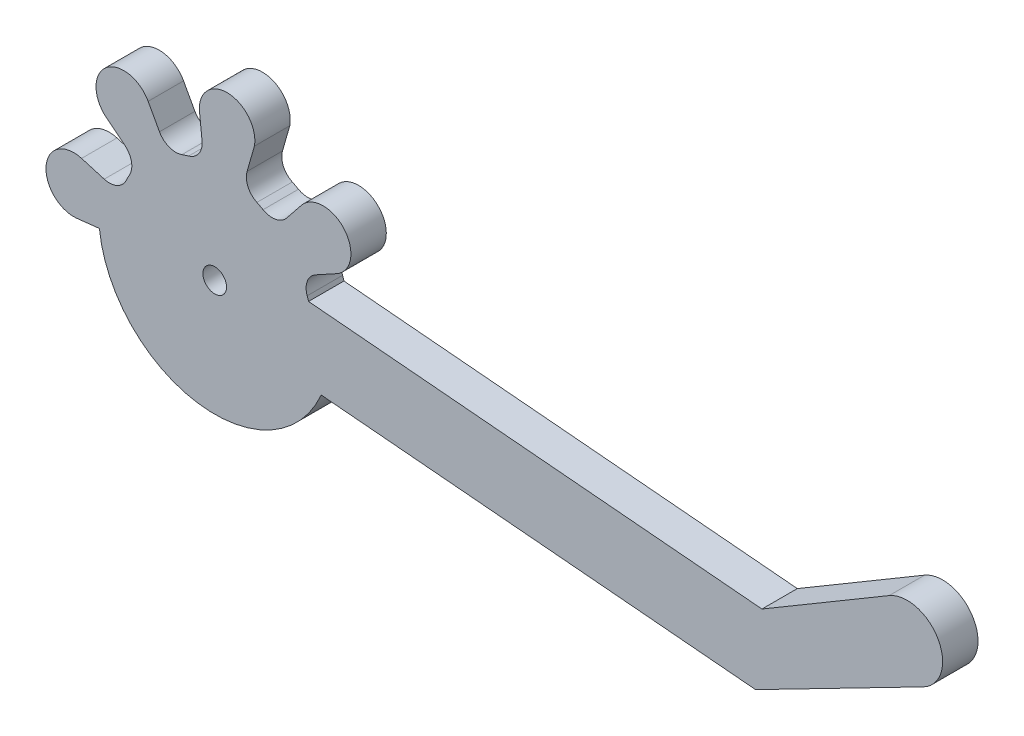
ISO-10303-21;
HEADER;
FILE_DESCRIPTION(('STEP AP214'),'2;1');
FILE_NAME('part.step','',(''),(''),'','','');
FILE_SCHEMA(('AUTOMOTIVE_DESIGN { 1 0 10303 214 1 1 1 1 }'));
ENDSEC;
DATA;
#1=APPLICATION_CONTEXT('core data for automotive mechanical design processes');
#2=APPLICATION_PROTOCOL_DEFINITION('international standard','automotive_design',2000,#1);
#3=PRODUCT_CONTEXT('',#1,'mechanical');
#4=PRODUCT('Part','Part','',(#3));
#5=PRODUCT_RELATED_PRODUCT_CATEGORY('part','',(#4));
#6=PRODUCT_DEFINITION_FORMATION('','',#4);
#7=PRODUCT_DEFINITION_CONTEXT('part definition',#1,'design');
#8=PRODUCT_DEFINITION('design','',#6,#7);
#9=PRODUCT_DEFINITION_SHAPE('','',#8);
#10=(LENGTH_UNIT() NAMED_UNIT(*) SI_UNIT(.MILLI.,.METRE.));
#11=(NAMED_UNIT(*) PLANE_ANGLE_UNIT() SI_UNIT($,.RADIAN.));
#12=(NAMED_UNIT(*) SI_UNIT($,.STERADIAN.) SOLID_ANGLE_UNIT());
#13=UNCERTAINTY_MEASURE_WITH_UNIT(LENGTH_MEASURE(1.E-05),#10,'distance_accuracy_value','');
#14=(GEOMETRIC_REPRESENTATION_CONTEXT(3) GLOBAL_UNCERTAINTY_ASSIGNED_CONTEXT((#13)) GLOBAL_UNIT_ASSIGNED_CONTEXT((#10,
#11,#12)) REPRESENTATION_CONTEXT('',''));
#15=CARTESIAN_POINT('',(0.,0.,0.));
#16=DIRECTION('',(0.,0.,1.));
#17=DIRECTION('',(1.,0.,0.));
#18=AXIS2_PLACEMENT_3D('',#15,#16,#17);
#19=CARTESIAN_POINT('',(2.20552189568856,24.9695299031335,3.));
#20=DIRECTION('',(0.,0.,1.));
#21=DIRECTION('',(1.,0.,0.));
#22=AXIS2_PLACEMENT_3D('',#19,#20,#21);
#23=PLANE('',#22);
#24=CARTESIAN_POINT('',(2.20552189568856,24.9695299031335,3.));
#25=DIRECTION('',(0.,0.,1.));
#26=DIRECTION('',(1.,0.,0.));
#27=AXIS2_PLACEMENT_3D('',#24,#25,#26);
#28=CIRCLE('',#27,2.35395199285645);
#29=CARTESIAN_POINT('',(4.27074653256969,26.0991037979682,3.));
#30=VERTEX_POINT('',#29);
#31=CARTESIAN_POINT('',(0.734486271788519,23.1318291173999,3.));
#32=VERTEX_POINT('',#31);
#33=EDGE_CURVE('E155',#30,#32,#28,.T.);
#34=ORIENTED_EDGE('',*,*,#33,.T.);
#35=DIRECTION('',(0.780687452995079,-0.624921675681086,0.));
#36=VECTOR('',#35,1.);
#37=CARTESIAN_POINT('',(2.2964918745804,21.881480908299,3.));
#38=LINE('',#37,#36);
#39=CARTESIAN_POINT('',(2.2964918745804,21.881480908299,3.));
#40=VERTEX_POINT('',#39);
#41=EDGE_CURVE('E468',#32,#40,#38,.T.);
#42=ORIENTED_EDGE('',*,*,#41,.T.);
#43=CARTESIAN_POINT('',(1.31580145927092,20.6563470519233,3.));
#44=DIRECTION('',(0.,0.,-1.));
#45=DIRECTION('',(1.,0.,0.));
#46=AXIS2_PLACEMENT_3D('',#43,#44,#45);
#47=CIRCLE('',#46,1.56930132757158);
#48=CARTESIAN_POINT('',(2.68115330109699,19.8827056575066,3.));
#49=VERTEX_POINT('',#48);
#50=EDGE_CURVE('E393',#40,#49,#47,.T.);
#51=ORIENTED_EDGE('',*,*,#50,.T.);
#52=CARTESIAN_POINT('',(9.91163847667758,15.7857377794938,3.));
#53=DIRECTION('',(0.,0.,1.));
#54=DIRECTION('',(1.,0.,0.));
#55=AXIS2_PLACEMENT_3D('',#52,#53,#54);
#56=CIRCLE('',#55,8.31053919236048);
#57=CARTESIAN_POINT('',(2.40836294622478,19.3586802600103,3.));
#58=VERTEX_POINT('',#57);
#59=EDGE_CURVE('E412',#49,#58,#56,.T.);
#60=ORIENTED_EDGE('',*,*,#59,.T.);
#61=CARTESIAN_POINT('',(0.991499373512298,20.0333685378642,3.));
#62=DIRECTION('',(0.,0.,-1.));
#63=DIRECTION('',(1.,0.,0.));
#64=AXIS2_PLACEMENT_3D('',#61,#62,#63);
#65=CIRCLE('',#64,1.56930132732789);
#66=CARTESIAN_POINT('',(0.550429384278587,18.5273260681608,3.));
#67=VERTEX_POINT('',#66);
#68=EDGE_CURVE('E409',#58,#67,#65,.T.);
#69=ORIENTED_EDGE('',*,*,#68,.T.);
#70=DIRECTION('',(-0.959689795584554,0.281061374526768,0.));
#71=VECTOR('',#70,1.);
#72=CARTESIAN_POINT('',(-1.36972551868818,19.0896758803763,3.));
#73=LINE('',#72,#71);
#74=CARTESIAN_POINT('',(-1.36972551868818,19.0896758803763,3.));
#75=VERTEX_POINT('',#74);
#76=EDGE_CURVE('E411',#67,#75,#73,.T.);
#77=ORIENTED_EDGE('',*,*,#76,.T.);
#78=CARTESIAN_POINT('',(-2.03133050323162,16.8306121740802,3.));
#79=DIRECTION('',(0.,0.,1.));
#80=DIRECTION('',(1.,0.,0.));
#81=AXIS2_PLACEMENT_3D('',#78,#79,#80);
#82=CIRCLE('',#81,2.35395199285732);
#83=CARTESIAN_POINT('',(-1.77205908085418,14.490982221664,3.));
#84=VERTEX_POINT('',#83);
#85=EDGE_CURVE('E414',#75,#84,#82,.T.);
#86=ORIENTED_EDGE('',*,*,#85,.T.);
#87=DIRECTION('',(0.993915746537626,0.110143037839678,0.));
#88=VECTOR('',#87,1.);
#89=CARTESIAN_POINT('',(0.138961898257982,14.7027563652451,3.));
#90=LINE('',#89,#88);
#91=CARTESIAN_POINT('',(0.138961898257964,14.7027563652451,3.));
#92=VERTEX_POINT('',#91);
#93=EDGE_CURVE('E420',#84,#92,#90,.T.);
#94=ORIENTED_EDGE('',*,*,#93,.T.);
#95=CARTESIAN_POINT('',(9.91163847667758,15.7857377794938,3.));
#96=DIRECTION('',(0.,0.,1.));
#97=DIRECTION('',(1.,0.,0.));
#98=AXIS2_PLACEMENT_3D('',#95,#96,#97);
#99=CIRCLE('',#98,9.83249999999997);
#100=CARTESIAN_POINT('',(18.9348827743616,11.8794455996494,3.));
#101=VERTEX_POINT('',#100);
#102=EDGE_CURVE('E422',#92,#101,#99,.T.);
#103=ORIENTED_EDGE('',*,*,#102,.T.);
#104=DIRECTION('',(0.996194698091745,-0.0871557427476604,0.));
#105=VECTOR('',#104,1.);
#106=CARTESIAN_POINT('',(55.7361887621411,8.65974852276994,3.));
#107=LINE('',#106,#105);
#108=CARTESIAN_POINT('',(55.7361887621411,8.65974852276994,3.));
#109=VERTEX_POINT('',#108);
#110=EDGE_CURVE('E424',#101,#109,#107,.T.);
#111=ORIENTED_EDGE('',*,*,#110,.T.);
#112=DIRECTION('',(0.889291076636205,0.457341645835167,0.));
#113=VECTOR('',#112,1.);
#114=CARTESIAN_POINT('',(55.7361887621411,8.65974852276994,3.));
#115=LINE('',#114,#113);
#116=CARTESIAN_POINT('',(69.9643683761599,15.9769692313453,3.));
#117=VERTEX_POINT('',#116);
#118=EDGE_CURVE('E426',#109,#117,#115,.T.);
#119=ORIENTED_EDGE('',*,*,#118,.T.);
#120=CARTESIAN_POINT('',(68.5852824960658,18.6411993519102,3.));
#121=DIRECTION('',(0.,0.,1.));
#122=DIRECTION('',(1.,0.,0.));
#123=AXIS2_PLACEMENT_3D('',#120,#121,#122);
#124=CIRCLE('',#123,3.00000000000001);
#125=CARTESIAN_POINT('',(67.0578742515332,21.2232574563172,3.));
#126=VERTEX_POINT('',#125);
#127=EDGE_CURVE('E428',#117,#126,#124,.T.);
#128=ORIENTED_EDGE('',*,*,#127,.T.);
#129=DIRECTION('',(-0.860686034802284,-0.509136081510947,0.));
#130=VECTOR('',#129,1.);
#131=CARTESIAN_POINT('',(56.2774259246038,14.8461175979193,3.));
#132=LINE('',#131,#130);
#133=CARTESIAN_POINT('',(56.2774259246038,14.8461175979193,3.));
#134=VERTEX_POINT('',#133);
#135=EDGE_CURVE('E430',#126,#134,#132,.T.);
#136=ORIENTED_EDGE('',*,*,#135,.T.);
#137=DIRECTION('',(-0.996194698218179,0.0871557413025172,0.));
#138=VECTOR('',#137,1.);
#139=CARTESIAN_POINT('',(17.861622062935,18.2070648798958,3.));
#140=LINE('',#139,#138);
#141=CARTESIAN_POINT('',(17.8616219989625,18.2070648604117,3.));
#142=VERTEX_POINT('',#141);
#143=EDGE_CURVE('E432',#134,#142,#140,.T.);
#144=ORIENTED_EDGE('',*,*,#143,.T.);
#145=CARTESIAN_POINT('',(9.91163847667758,15.7857377794938,3.));
#146=DIRECTION('',(0.,0.,1.));
#147=DIRECTION('',(1.,0.,0.));
#148=AXIS2_PLACEMENT_3D('',#145,#146,#147);
#149=CIRCLE('',#148,8.31053926273072);
#150=CARTESIAN_POINT('',(17.7437073453175,18.5649029352116,3.));
#151=VERTEX_POINT('',#150);
#152=EDGE_CURVE('E434',#142,#151,#149,.T.);
#153=ORIENTED_EDGE('',*,*,#152,.T.);
#154=CARTESIAN_POINT('',(19.2226578423204,19.0897001190196,3.));
#155=DIRECTION('',(0.,0.,-1.));
#156=DIRECTION('',(1.,0.,0.));
#157=AXIS2_PLACEMENT_3D('',#154,#155,#156);
#158=CIRCLE('',#157,1.56930132757161);
#159=CARTESIAN_POINT('',(18.4696085795766,20.4665165427301,3.));
#160=VERTEX_POINT('',#159);
#161=EDGE_CURVE('E436',#151,#160,#158,.T.);
#162=ORIENTED_EDGE('',*,*,#161,.T.);
#163=DIRECTION('',(0.877343566555494,0.479862757696079,0.));
#164=VECTOR('',#163,1.);
#165=CARTESIAN_POINT('',(20.225004495414,21.4266297265872,3.));
#166=LINE('',#165,#164);
#167=CARTESIAN_POINT('',(20.225004495414,21.4266297265872,3.));
#168=VERTEX_POINT('',#167);
#169=EDGE_CURVE('E438',#160,#168,#166,.T.);
#170=ORIENTED_EDGE('',*,*,#169,.T.);
#171=CARTESIAN_POINT('',(19.0954306005801,23.4918543634683,3.));
#172=DIRECTION('',(0.,0.,1.));
#173=DIRECTION('',(1.,0.,0.));
#174=AXIS2_PLACEMENT_3D('',#171,#172,#173);
#175=CIRCLE('',#174,2.35395199285601);
#176=CARTESIAN_POINT('',(17.2577298148456,24.9628899873683,3.));
#177=VERTEX_POINT('',#176);
#178=EDGE_CURVE('E440',#168,#177,#175,.T.);
#179=ORIENTED_EDGE('',*,*,#178,.T.);
#180=DIRECTION('',(-0.624921675680768,-0.780687452995333,0.));
#181=VECTOR('',#180,1.);
#182=CARTESIAN_POINT('',(16.0073816057455,23.400884384576,3.));
#183=LINE('',#182,#181);
#184=CARTESIAN_POINT('',(16.0073816057455,23.400884384576,3.));
#185=VERTEX_POINT('',#184);
#186=EDGE_CURVE('E442',#177,#185,#183,.T.);
#187=ORIENTED_EDGE('',*,*,#186,.T.);
#188=CARTESIAN_POINT('',(14.7822477493697,24.3815747998855,3.));
#189=DIRECTION('',(0.,0.,-1.));
#190=DIRECTION('',(1.,0.,0.));
#191=AXIS2_PLACEMENT_3D('',#188,#189,#190);
#192=CIRCLE('',#191,1.56930132757157);
#193=CARTESIAN_POINT('',(14.0086063553325,23.0162229587288,3.));
#194=VERTEX_POINT('',#193);
#195=EDGE_CURVE('E444',#185,#194,#192,.T.);
#196=ORIENTED_EDGE('',*,*,#195,.T.);
#197=DIRECTION('',(-0.887010834511609,0.46174861067362,0.));
#198=VECTOR('',#197,1.);
#199=CARTESIAN_POINT('',(13.4845809574635,23.2890133125883,3.));
#200=LINE('',#199,#198);
#201=CARTESIAN_POINT('',(13.4845809574635,23.2890133125883,3.));
#202=VERTEX_POINT('',#201);
#203=EDGE_CURVE('E446',#194,#202,#200,.T.);
#204=ORIENTED_EDGE('',*,*,#203,.T.);
#205=CARTESIAN_POINT('',(14.1592692355152,24.7058768854765,3.));
#206=DIRECTION('',(0.,0.,-1.));
#207=DIRECTION('',(1.,0.,0.));
#208=AXIS2_PLACEMENT_3D('',#205,#206,#207);
#209=CIRCLE('',#208,1.56930132757157);
#210=CARTESIAN_POINT('',(12.6532267656069,25.1469468748776,3.));
#211=VERTEX_POINT('',#210);
#212=EDGE_CURVE('E448',#202,#211,#209,.T.);
#213=ORIENTED_EDGE('',*,*,#212,.T.);
#214=DIRECTION('',(0.275451101956375,0.961315083846612,0.));
#215=VECTOR('',#214,1.);
#216=CARTESIAN_POINT('',(13.2727699187403,27.3091316473145,3.));
#217=LINE('',#216,#215);
#218=CARTESIAN_POINT('',(13.2727699187403,27.3091316473145,3.));
#219=VERTEX_POINT('',#218);
#220=EDGE_CURVE('E450',#211,#219,#217,.T.);
#221=ORIENTED_EDGE('',*,*,#220,.T.);
#222=CARTESIAN_POINT('',(10.9565128712596,27.7287067593819,3.));
#223=DIRECTION('',(0.,0.,1.));
#224=DIRECTION('',(1.,0.,0.));
#225=AXIS2_PLACEMENT_3D('',#222,#223,#224);
#226=CIRCLE('',#225,2.35395199285593);
#227=CARTESIAN_POINT('',(8.60258651932652,27.7177197513502,3.));
#228=VERTEX_POINT('',#227);
#229=EDGE_CURVE('E452',#219,#228,#226,.T.);
#230=ORIENTED_EDGE('',*,*,#229,.T.);
#231=DIRECTION('',(0.104335769573791,-0.994542129418078,0.));
#232=VECTOR('',#231,1.);
#233=CARTESIAN_POINT('',(8.83725797740522,25.4808008827337,3.));
#234=LINE('',#233,#232);
#235=CARTESIAN_POINT('',(8.83725797740522,25.4808008827337,3.));
#236=VERTEX_POINT('',#235);
#237=EDGE_CURVE('E454',#228,#236,#234,.T.);
#238=ORIENTED_EDGE('',*,*,#237,.T.);
#239=CARTESIAN_POINT('',(7.27750467678122,25.3079532679456,3.));
#240=DIRECTION('',(0.,0.,-1.));
#241=DIRECTION('',(1.,0.,0.));
#242=AXIS2_PLACEMENT_3D('',#239,#240,#241);
#243=CIRCLE('',#242,1.56930132758033);
#244=CARTESIAN_POINT('',(7.69590714643339,23.7954566464173,3.));
#245=VERTEX_POINT('',#244);
#246=EDGE_CURVE('E238',#236,#245,#243,.T.);
#247=ORIENTED_EDGE('',*,*,#246,.T.);
#248=CARTESIAN_POINT('',(9.91163847667758,15.7857377794938,3.));
#249=DIRECTION('',(0.,0.,1.));
#250=DIRECTION('',(1.,0.,0.));
#251=AXIS2_PLACEMENT_3D('',#248,#249,#250);
#252=CIRCLE('',#251,8.31053919159139);
#253=CARTESIAN_POINT('',(7.13247332479957,23.6178066449701,3.));
#254=VERTEX_POINT('',#253);
#255=EDGE_CURVE('E232',#245,#254,#252,.T.);
#256=ORIENTED_EDGE('',*,*,#255,.T.);
#257=CARTESIAN_POINT('',(6.60767614226689,25.0967571439252,3.));
#258=DIRECTION('',(0.,0.,-1.));
#259=DIRECTION('',(1.,0.,0.));
#260=AXIS2_PLACEMENT_3D('',#257,#258,#259);
#261=CIRCLE('',#260,1.56930132898491);
#262=CARTESIAN_POINT('',(5.23085971642636,24.3437078821305,3.));
#263=VERTEX_POINT('',#262);
#264=EDGE_CURVE('E236',#254,#263,#261,.T.);
#265=ORIENTED_EDGE('',*,*,#264,.T.);
#266=DIRECTION('',(-0.479862757695843,0.877343566555623,0.));
#267=VECTOR('',#266,1.);
#268=CARTESIAN_POINT('',(4.27074653256969,26.0991037979682,3.));
#269=LINE('',#268,#267);
#270=EDGE_CURVE('E50',#263,#30,#269,.T.);
#271=ORIENTED_EDGE('',*,*,#270,.T.);
#272=EDGE_LOOP('',(#34,#42,#51,#60,#69,#77,#86,#94,#103,#111,#119,#128,#136,#144,#153,#162,#170,
#179,#187,#196,#204,#213,#221,#230,#238,#247,#256,#265,#271));
#273=FACE_BOUND('',#272,.T.);
#274=CARTESIAN_POINT('',(9.91163847667758,15.7857377794938,3.));
#275=DIRECTION('',(0.,0.,1.));
#276=DIRECTION('',(1.,0.,0.));
#277=AXIS2_PLACEMENT_3D('',#274,#275,#276);
#278=CIRCLE('',#277,0.999999999999999);
#279=CARTESIAN_POINT('',(10.9116384766776,15.7857377794938,3.));
#280=VERTEX_POINT('',#279);
#281=EDGE_CURVE('E258',#280,#280,#278,.T.);
#282=ORIENTED_EDGE('',*,*,#281,.F.);
#283=EDGE_LOOP('',(#282));
#284=FACE_BOUND('',#283,.T.);
#285=ADVANCED_FACE('F33',(#273,#284),#23,.T.);
#286=CARTESIAN_POINT('',(2.20552189568856,24.9695299031335,0.));
#287=DIRECTION('',(0.,0.,1.));
#288=DIRECTION('',(1.,0.,0.));
#289=AXIS2_PLACEMENT_3D('',#286,#287,#288);
#290=PLANE('',#289);
#291=CARTESIAN_POINT('',(2.20552189568856,24.9695299031335,0.));
#292=DIRECTION('',(0.,0.,1.));
#293=DIRECTION('',(1.,0.,0.));
#294=AXIS2_PLACEMENT_3D('',#291,#292,#293);
#295=CIRCLE('',#294,2.35395199285548);
#296=CARTESIAN_POINT('',(4.27074653256969,26.0991037979682,0.));
#297=VERTEX_POINT('',#296);
#298=CARTESIAN_POINT('',(0.734486271788519,23.1318291173999,0.));
#299=VERTEX_POINT('',#298);
#300=EDGE_CURVE('E149',#297,#299,#295,.T.);
#301=ORIENTED_EDGE('',*,*,#300,.F.);
#302=DIRECTION('',(-0.479862757695843,0.877343566555623,0.));
#303=VECTOR('',#302,1.);
#304=CARTESIAN_POINT('',(4.27074653256969,26.0991037979682,0.));
#305=LINE('',#304,#303);
#306=CARTESIAN_POINT('',(5.23085971642636,24.3437078821305,0.));
#307=VERTEX_POINT('',#306);
#308=EDGE_CURVE('E312',#307,#297,#305,.T.);
#309=ORIENTED_EDGE('',*,*,#308,.F.);
#310=CARTESIAN_POINT('',(6.60767614226689,25.0967571439252,0.));
#311=DIRECTION('',(0.,0.,-1.));
#312=DIRECTION('',(1.,0.,0.));
#313=AXIS2_PLACEMENT_3D('',#310,#311,#312);
#314=CIRCLE('',#313,1.56930132898491);
#315=CARTESIAN_POINT('',(7.13247332479957,23.6178066449701,0.));
#316=VERTEX_POINT('',#315);
#317=EDGE_CURVE('E142',#316,#307,#314,.T.);
#318=ORIENTED_EDGE('',*,*,#317,.F.);
#319=CARTESIAN_POINT('',(9.91163847667758,15.7857377794938,0.));
#320=DIRECTION('',(0.,0.,1.));
#321=DIRECTION('',(1.,0.,0.));
#322=AXIS2_PLACEMENT_3D('',#319,#320,#321);
#323=CIRCLE('',#322,8.31053919159139);
#324=CARTESIAN_POINT('',(7.69590714643339,23.7954566464173,0.));
#325=VERTEX_POINT('',#324);
#326=EDGE_CURVE('E246',#325,#316,#323,.T.);
#327=ORIENTED_EDGE('',*,*,#326,.F.);
#328=CARTESIAN_POINT('',(7.27750467678122,25.3079532679456,0.));
#329=DIRECTION('',(0.,0.,-1.));
#330=DIRECTION('',(1.,0.,0.));
#331=AXIS2_PLACEMENT_3D('',#328,#329,#330);
#332=CIRCLE('',#331,1.56930132758033);
#333=CARTESIAN_POINT('',(8.83725797740522,25.4808008827337,0.));
#334=VERTEX_POINT('',#333);
#335=EDGE_CURVE('E308',#334,#325,#332,.T.);
#336=ORIENTED_EDGE('',*,*,#335,.F.);
#337=DIRECTION('',(0.104335769573791,-0.994542129418078,0.));
#338=VECTOR('',#337,1.);
#339=CARTESIAN_POINT('',(8.83725797740522,25.4808008827337,0.));
#340=LINE('',#339,#338);
#341=CARTESIAN_POINT('',(8.60258651932652,27.7177197513502,0.));
#342=VERTEX_POINT('',#341);
#343=EDGE_CURVE('E306',#342,#334,#340,.T.);
#344=ORIENTED_EDGE('',*,*,#343,.F.);
#345=CARTESIAN_POINT('',(10.9565128712596,27.7287067593819,0.));
#346=DIRECTION('',(0.,0.,1.));
#347=DIRECTION('',(1.,0.,0.));
#348=AXIS2_PLACEMENT_3D('',#345,#346,#347);
#349=CIRCLE('',#348,2.35395199285593);
#350=CARTESIAN_POINT('',(13.2727699187403,27.3091316473145,0.));
#351=VERTEX_POINT('',#350);
#352=EDGE_CURVE('E304',#351,#342,#349,.T.);
#353=ORIENTED_EDGE('',*,*,#352,.F.);
#354=DIRECTION('',(0.275451101956375,0.961315083846612,0.));
#355=VECTOR('',#354,1.);
#356=CARTESIAN_POINT('',(13.2727699187403,27.3091316473145,0.));
#357=LINE('',#356,#355);
#358=CARTESIAN_POINT('',(12.6532267656069,25.1469468748776,0.));
#359=VERTEX_POINT('',#358);
#360=EDGE_CURVE('E302',#359,#351,#357,.T.);
#361=ORIENTED_EDGE('',*,*,#360,.F.);
#362=CARTESIAN_POINT('',(14.1592692355152,24.7058768854765,0.));
#363=DIRECTION('',(0.,0.,-1.));
#364=DIRECTION('',(1.,0.,0.));
#365=AXIS2_PLACEMENT_3D('',#362,#363,#364);
#366=CIRCLE('',#365,1.56930132757157);
#367=CARTESIAN_POINT('',(13.4845809574635,23.2890133125883,0.));
#368=VERTEX_POINT('',#367);
#369=EDGE_CURVE('E300',#368,#359,#366,.T.);
#370=ORIENTED_EDGE('',*,*,#369,.F.);
#371=DIRECTION('',(-0.887010834511609,0.46174861067362,0.));
#372=VECTOR('',#371,1.);
#373=CARTESIAN_POINT('',(13.4845809574635,23.2890133125883,0.));
#374=LINE('',#373,#372);
#375=CARTESIAN_POINT('',(14.0086063553325,23.0162229587288,0.));
#376=VERTEX_POINT('',#375);
#377=EDGE_CURVE('E298',#376,#368,#374,.T.);
#378=ORIENTED_EDGE('',*,*,#377,.F.);
#379=CARTESIAN_POINT('',(14.7822477493697,24.3815747998855,0.));
#380=DIRECTION('',(0.,0.,-1.));
#381=DIRECTION('',(1.,0.,0.));
#382=AXIS2_PLACEMENT_3D('',#379,#380,#381);
#383=CIRCLE('',#382,1.56930132757157);
#384=CARTESIAN_POINT('',(16.0073816057455,23.400884384576,0.));
#385=VERTEX_POINT('',#384);
#386=EDGE_CURVE('E296',#385,#376,#383,.T.);
#387=ORIENTED_EDGE('',*,*,#386,.F.);
#388=DIRECTION('',(-0.624921675680768,-0.780687452995333,0.));
#389=VECTOR('',#388,1.);
#390=CARTESIAN_POINT('',(16.0073816057455,23.400884384576,0.));
#391=LINE('',#390,#389);
#392=CARTESIAN_POINT('',(17.2577298148456,24.9628899873683,0.));
#393=VERTEX_POINT('',#392);
#394=EDGE_CURVE('E294',#393,#385,#391,.T.);
#395=ORIENTED_EDGE('',*,*,#394,.F.);
#396=CARTESIAN_POINT('',(19.0954306005801,23.4918543634683,0.));
#397=DIRECTION('',(0.,0.,1.));
#398=DIRECTION('',(1.,0.,0.));
#399=AXIS2_PLACEMENT_3D('',#396,#397,#398);
#400=CIRCLE('',#399,2.35395199285622);
#401=CARTESIAN_POINT('',(20.225004495414,21.4266297265872,0.));
#402=VERTEX_POINT('',#401);
#403=EDGE_CURVE('E292',#402,#393,#400,.T.);
#404=ORIENTED_EDGE('',*,*,#403,.F.);
#405=DIRECTION('',(0.877343566555494,0.479862757696079,0.));
#406=VECTOR('',#405,1.);
#407=CARTESIAN_POINT('',(20.225004495414,21.4266297265872,0.));
#408=LINE('',#407,#406);
#409=CARTESIAN_POINT('',(18.4696085795766,20.4665165427301,0.));
#410=VERTEX_POINT('',#409);
#411=EDGE_CURVE('E289',#410,#402,#408,.T.);
#412=ORIENTED_EDGE('',*,*,#411,.F.);
#413=CARTESIAN_POINT('',(19.2226578423204,19.0897001190196,0.));
#414=DIRECTION('',(0.,0.,-1.));
#415=DIRECTION('',(1.,0.,0.));
#416=AXIS2_PLACEMENT_3D('',#413,#414,#415);
#417=CIRCLE('',#416,1.56930132757161);
#418=CARTESIAN_POINT('',(17.7437073453175,18.5649029352116,0.));
#419=VERTEX_POINT('',#418);
#420=EDGE_CURVE('E287',#419,#410,#417,.T.);
#421=ORIENTED_EDGE('',*,*,#420,.F.);
#422=CARTESIAN_POINT('',(9.91163847667758,15.7857377794938,0.));
#423=DIRECTION('',(0.,0.,1.));
#424=DIRECTION('',(1.,0.,0.));
#425=AXIS2_PLACEMENT_3D('',#422,#423,#424);
#426=CIRCLE('',#425,8.31053926273072);
#427=CARTESIAN_POINT('',(17.8616219989625,18.2070648604117,0.));
#428=VERTEX_POINT('',#427);
#429=EDGE_CURVE('E285',#428,#419,#426,.T.);
#430=ORIENTED_EDGE('',*,*,#429,.F.);
#431=DIRECTION('',(-0.996194698218179,0.0871557413025172,0.));
#432=VECTOR('',#431,1.);
#433=CARTESIAN_POINT('',(17.861622062935,18.2070648798958,0.));
#434=LINE('',#433,#432);
#435=CARTESIAN_POINT('',(56.2774259246038,14.8461175979193,0.));
#436=VERTEX_POINT('',#435);
#437=EDGE_CURVE('E283',#436,#428,#434,.T.);
#438=ORIENTED_EDGE('',*,*,#437,.F.);
#439=DIRECTION('',(-0.860686034802284,-0.509136081510947,0.));
#440=VECTOR('',#439,1.);
#441=CARTESIAN_POINT('',(56.2774259246038,14.8461175979193,0.));
#442=LINE('',#441,#440);
#443=CARTESIAN_POINT('',(67.0578742515332,21.2232574563172,0.));
#444=VERTEX_POINT('',#443);
#445=EDGE_CURVE('E281',#444,#436,#442,.T.);
#446=ORIENTED_EDGE('',*,*,#445,.F.);
#447=CARTESIAN_POINT('',(68.5852824960658,18.6411993519102,0.));
#448=DIRECTION('',(0.,0.,1.));
#449=DIRECTION('',(1.,0.,0.));
#450=AXIS2_PLACEMENT_3D('',#447,#448,#449);
#451=CIRCLE('',#450,3.00000000000001);
#452=CARTESIAN_POINT('',(69.9643683761599,15.9769692313453,0.));
#453=VERTEX_POINT('',#452);
#454=EDGE_CURVE('E279',#453,#444,#451,.T.);
#455=ORIENTED_EDGE('',*,*,#454,.F.);
#456=DIRECTION('',(0.889291076636205,0.457341645835167,0.));
#457=VECTOR('',#456,1.);
#458=CARTESIAN_POINT('',(55.7361887621411,8.65974852276994,0.));
#459=LINE('',#458,#457);
#460=CARTESIAN_POINT('',(55.7361887621411,8.65974852276994,0.));
#461=VERTEX_POINT('',#460);
#462=EDGE_CURVE('E277',#461,#453,#459,.T.);
#463=ORIENTED_EDGE('',*,*,#462,.F.);
#464=DIRECTION('',(0.996194698091745,-0.0871557427476604,0.));
#465=VECTOR('',#464,1.);
#466=CARTESIAN_POINT('',(55.7361887621411,8.65974852276994,0.));
#467=LINE('',#466,#465);
#468=CARTESIAN_POINT('',(18.9348827743616,11.8794455996494,0.));
#469=VERTEX_POINT('',#468);
#470=EDGE_CURVE('E275',#469,#461,#467,.T.);
#471=ORIENTED_EDGE('',*,*,#470,.F.);
#472=CARTESIAN_POINT('',(9.91163847667758,15.7857377794938,0.));
#473=DIRECTION('',(0.,0.,1.));
#474=DIRECTION('',(1.,0.,0.));
#475=AXIS2_PLACEMENT_3D('',#472,#473,#474);
#476=CIRCLE('',#475,9.83249999999997);
#477=CARTESIAN_POINT('',(0.138961898257964,14.7027563652451,0.));
#478=VERTEX_POINT('',#477);
#479=EDGE_CURVE('E273',#478,#469,#476,.T.);
#480=ORIENTED_EDGE('',*,*,#479,.F.);
#481=DIRECTION('',(0.993915746537626,0.110143037839678,0.));
#482=VECTOR('',#481,1.);
#483=CARTESIAN_POINT('',(0.138961898257982,14.7027563652451,0.));
#484=LINE('',#483,#482);
#485=CARTESIAN_POINT('',(-1.77205908085418,14.490982221664,0.));
#486=VERTEX_POINT('',#485);
#487=EDGE_CURVE('E271',#486,#478,#484,.T.);
#488=ORIENTED_EDGE('',*,*,#487,.F.);
#489=CARTESIAN_POINT('',(-2.03133050323162,16.8306121740802,0.));
#490=DIRECTION('',(0.,0.,1.));
#491=DIRECTION('',(1.,0.,0.));
#492=AXIS2_PLACEMENT_3D('',#489,#490,#491);
#493=CIRCLE('',#492,2.35395199286196);
#494=CARTESIAN_POINT('',(-1.36972551868818,19.0896758803763,0.));
#495=VERTEX_POINT('',#494);
#496=EDGE_CURVE('E269',#495,#486,#493,.T.);
#497=ORIENTED_EDGE('',*,*,#496,.F.);
#498=DIRECTION('',(-0.959689795584554,0.281061374526768,0.));
#499=VECTOR('',#498,1.);
#500=CARTESIAN_POINT('',(-1.36972551868818,19.0896758803763,0.));
#501=LINE('',#500,#499);
#502=CARTESIAN_POINT('',(0.550429384278587,18.5273260681608,0.));
#503=VERTEX_POINT('',#502);
#504=EDGE_CURVE('E266',#503,#495,#501,.T.);
#505=ORIENTED_EDGE('',*,*,#504,.F.);
#506=CARTESIAN_POINT('',(0.991499373512298,20.0333685378642,0.));
#507=DIRECTION('',(0.,0.,-1.));
#508=DIRECTION('',(1.,0.,0.));
#509=AXIS2_PLACEMENT_3D('',#506,#507,#508);
#510=CIRCLE('',#509,1.56930132732789);
#511=CARTESIAN_POINT('',(2.40836294622478,19.3586802600103,0.));
#512=VERTEX_POINT('',#511);
#513=EDGE_CURVE('E264',#512,#503,#510,.T.);
#514=ORIENTED_EDGE('',*,*,#513,.F.);
#515=CARTESIAN_POINT('',(9.91163847667758,15.7857377794938,0.));
#516=DIRECTION('',(0.,0.,1.));
#517=DIRECTION('',(1.,0.,0.));
#518=AXIS2_PLACEMENT_3D('',#515,#516,#517);
#519=CIRCLE('',#518,8.31053919236048);
#520=CARTESIAN_POINT('',(2.68115330109699,19.8827056575066,0.));
#521=VERTEX_POINT('',#520);
#522=EDGE_CURVE('E262',#521,#512,#519,.T.);
#523=ORIENTED_EDGE('',*,*,#522,.F.);
#524=CARTESIAN_POINT('',(1.31580145927092,20.6563470519233,0.));
#525=DIRECTION('',(0.,0.,-1.));
#526=DIRECTION('',(1.,0.,0.));
#527=AXIS2_PLACEMENT_3D('',#524,#525,#526);
#528=CIRCLE('',#527,1.56930132757158);
#529=CARTESIAN_POINT('',(2.2964918745804,21.881480908299,0.));
#530=VERTEX_POINT('',#529);
#531=EDGE_CURVE('E260',#530,#521,#528,.T.);
#532=ORIENTED_EDGE('',*,*,#531,.F.);
#533=DIRECTION('',(0.780687452995079,-0.624921675681086,0.));
#534=VECTOR('',#533,1.);
#535=CARTESIAN_POINT('',(2.2964918745804,21.881480908299,0.));
#536=LINE('',#535,#534);
#537=EDGE_CURVE('E257',#299,#530,#536,.T.);
#538=ORIENTED_EDGE('',*,*,#537,.F.);
#539=EDGE_LOOP('',(#301,#309,#318,#327,#336,#344,#353,#361,#370,#378,#387,#395,#404,#412,#421,
#430,#438,#446,#455,#463,#471,#480,#488,#497,#505,#514,#523,#532,#538));
#540=FACE_BOUND('',#539,.T.);
#541=CARTESIAN_POINT('',(9.91163847667758,15.7857377794938,0.));
#542=DIRECTION('',(0.,0.,1.));
#543=DIRECTION('',(1.,0.,0.));
#544=AXIS2_PLACEMENT_3D('',#541,#542,#543);
#545=CIRCLE('',#544,0.999999999999999);
#546=CARTESIAN_POINT('',(10.9116384766776,15.7857377794938,0.));
#547=VERTEX_POINT('',#546);
#548=EDGE_CURVE('E472',#547,#547,#545,.T.);
#549=ORIENTED_EDGE('',*,*,#548,.T.);
#550=EDGE_LOOP('',(#549));
#551=FACE_BOUND('',#550,.T.);
#552=ADVANCED_FACE('F397',(#540,#551),#290,.F.);
#553=CARTESIAN_POINT('',(2.20552189568856,24.9695299031335,3.));
#554=DIRECTION('',(0.,0.,-1.));
#555=DIRECTION('',(-1.,0.,0.));
#556=AXIS2_PLACEMENT_3D('',#553,#554,#555);
#557=CYLINDRICAL_SURFACE('',#556,2.35395199285548);
#558=ORIENTED_EDGE('',*,*,#300,.T.);
#559=DIRECTION('',(0.,0.,-1.));
#560=VECTOR('',#559,1.);
#561=CARTESIAN_POINT('',(0.734486271788519,23.1318291173999,3.));
#562=LINE('',#561,#560);
#563=EDGE_CURVE('E11',#32,#299,#562,.T.);
#564=ORIENTED_EDGE('',*,*,#563,.F.);
#565=ORIENTED_EDGE('',*,*,#33,.F.);
#566=DIRECTION('',(0.,0.,-1.));
#567=VECTOR('',#566,1.);
#568=CARTESIAN_POINT('',(4.27074653256969,26.0991037979682,3.));
#569=LINE('',#568,#567);
#570=EDGE_CURVE('E252',#30,#297,#569,.T.);
#571=ORIENTED_EDGE('',*,*,#570,.T.);
#572=EDGE_LOOP('',(#558,#564,#565,#571));
#573=FACE_BOUND('',#572,.T.);
#574=ADVANCED_FACE('F35',(#573),#557,.T.);
#575=CARTESIAN_POINT('',(2.2964918745804,21.881480908299,3.));
#576=DIRECTION('',(0.624921675681086,0.780687452995079,0.));
#577=DIRECTION('',(-0.780687452995079,0.624921675681086,0.));
#578=AXIS2_PLACEMENT_3D('',#575,#576,#577);
#579=PLANE('',#578);
#580=ORIENTED_EDGE('',*,*,#537,.T.);
#581=DIRECTION('',(0.,0.,-1.));
#582=VECTOR('',#581,1.);
#583=CARTESIAN_POINT('',(2.2964918745804,21.881480908299,3.));
#584=LINE('',#583,#582);
#585=EDGE_CURVE('E42',#40,#530,#584,.T.);
#586=ORIENTED_EDGE('',*,*,#585,.F.);
#587=ORIENTED_EDGE('',*,*,#41,.F.);
#588=ORIENTED_EDGE('',*,*,#563,.T.);
#589=EDGE_LOOP('',(#580,#586,#587,#588));
#590=FACE_BOUND('',#589,.T.);
#591=ADVANCED_FACE('F474',(#590),#579,.F.);
#592=CARTESIAN_POINT('',(1.31580145927092,20.6563470519233,3.));
#593=DIRECTION('',(0.,0.,-1.));
#594=DIRECTION('',(-1.,0.,0.));
#595=AXIS2_PLACEMENT_3D('',#592,#593,#594);
#596=CYLINDRICAL_SURFACE('',#595,1.56930132757158);
#597=ORIENTED_EDGE('',*,*,#531,.T.);
#598=DIRECTION('',(0.,0.,-1.));
#599=VECTOR('',#598,1.);
#600=CARTESIAN_POINT('',(2.68115330109699,19.8827056575066,3.));
#601=LINE('',#600,#599);
#602=EDGE_CURVE('E384',#49,#521,#601,.T.);
#603=ORIENTED_EDGE('',*,*,#602,.F.);
#604=ORIENTED_EDGE('',*,*,#50,.F.);
#605=ORIENTED_EDGE('',*,*,#585,.T.);
#606=EDGE_LOOP('',(#597,#603,#604,#605));
#607=FACE_BOUND('',#606,.T.);
#608=ADVANCED_FACE('F391',(#607),#596,.F.);
#609=CARTESIAN_POINT('',(9.91163847667758,15.7857377794938,3.));
#610=DIRECTION('',(0.,0.,-1.));
#611=DIRECTION('',(-1.,0.,0.));
#612=AXIS2_PLACEMENT_3D('',#609,#610,#611);
#613=CYLINDRICAL_SURFACE('',#612,8.31053919236048);
#614=ORIENTED_EDGE('',*,*,#522,.T.);
#615=DIRECTION('',(0.,0.,-1.));
#616=VECTOR('',#615,1.);
#617=CARTESIAN_POINT('',(2.40836294622478,19.3586802600103,3.));
#618=LINE('',#617,#616);
#619=EDGE_CURVE('E381',#58,#512,#618,.T.);
#620=ORIENTED_EDGE('',*,*,#619,.F.);
#621=ORIENTED_EDGE('',*,*,#59,.F.);
#622=ORIENTED_EDGE('',*,*,#602,.T.);
#623=EDGE_LOOP('',(#614,#620,#621,#622));
#624=FACE_BOUND('',#623,.T.);
#625=ADVANCED_FACE('F403',(#624),#613,.T.);
#626=CARTESIAN_POINT('',(0.991499373512298,20.0333685378642,3.));
#627=DIRECTION('',(0.,0.,-1.));
#628=DIRECTION('',(-1.,0.,0.));
#629=AXIS2_PLACEMENT_3D('',#626,#627,#628);
#630=CYLINDRICAL_SURFACE('',#629,1.56930132732789);
#631=ORIENTED_EDGE('',*,*,#513,.T.);
#632=DIRECTION('',(0.,0.,-1.));
#633=VECTOR('',#632,1.);
#634=CARTESIAN_POINT('',(0.550429384278587,18.5273260681608,3.));
#635=LINE('',#634,#633);
#636=EDGE_CURVE('E378',#67,#503,#635,.T.);
#637=ORIENTED_EDGE('',*,*,#636,.F.);
#638=ORIENTED_EDGE('',*,*,#68,.F.);
#639=ORIENTED_EDGE('',*,*,#619,.T.);
#640=EDGE_LOOP('',(#631,#637,#638,#639));
#641=FACE_BOUND('',#640,.T.);
#642=ADVANCED_FACE('F407',(#641),#630,.F.);
#643=CARTESIAN_POINT('',(-1.36972551868818,19.0896758803763,3.));
#644=DIRECTION('',(-0.281061374526768,-0.959689795584554,0.));
#645=DIRECTION('',(0.959689795584554,-0.281061374526768,0.));
#646=AXIS2_PLACEMENT_3D('',#643,#644,#645);
#647=PLANE('',#646);
#648=ORIENTED_EDGE('',*,*,#504,.T.);
#649=DIRECTION('',(0.,0.,-1.));
#650=VECTOR('',#649,1.);
#651=CARTESIAN_POINT('',(-1.36972551868818,19.0896758803763,3.));
#652=LINE('',#651,#650);
#653=EDGE_CURVE('E375',#75,#495,#652,.T.);
#654=ORIENTED_EDGE('',*,*,#653,.F.);
#655=ORIENTED_EDGE('',*,*,#76,.F.);
#656=ORIENTED_EDGE('',*,*,#636,.T.);
#657=EDGE_LOOP('',(#648,#654,#655,#656));
#658=FACE_BOUND('',#657,.T.);
#659=ADVANCED_FACE('F571',(#658),#647,.F.);
#660=CARTESIAN_POINT('',(-2.03133050323162,16.8306121740802,3.));
#661=DIRECTION('',(0.,0.,-1.));
#662=DIRECTION('',(-1.,0.,0.));
#663=AXIS2_PLACEMENT_3D('',#660,#661,#662);
#664=CYLINDRICAL_SURFACE('',#663,2.35395199286196);
#665=ORIENTED_EDGE('',*,*,#496,.T.);
#666=DIRECTION('',(0.,0.,-1.));
#667=VECTOR('',#666,1.);
#668=CARTESIAN_POINT('',(-1.77205908085418,14.490982221664,3.));
#669=LINE('',#668,#667);
#670=EDGE_CURVE('E372',#84,#486,#669,.T.);
#671=ORIENTED_EDGE('',*,*,#670,.F.);
#672=ORIENTED_EDGE('',*,*,#85,.F.);
#673=ORIENTED_EDGE('',*,*,#653,.T.);
#674=EDGE_LOOP('',(#665,#671,#672,#673));
#675=FACE_BOUND('',#674,.T.);
#676=ADVANCED_FACE('F567',(#675),#664,.T.);
#677=CARTESIAN_POINT('',(0.138961898257982,14.7027563652451,3.));
#678=DIRECTION('',(-0.110143037839678,0.993915746537626,0.));
#679=DIRECTION('',(-0.993915746537627,-0.110143037839678,0.));
#680=AXIS2_PLACEMENT_3D('',#677,#678,#679);
#681=PLANE('',#680);
#682=ORIENTED_EDGE('',*,*,#487,.T.);
#683=DIRECTION('',(0.,0.,-1.));
#684=VECTOR('',#683,1.);
#685=CARTESIAN_POINT('',(0.138961898257964,14.7027563652451,3.));
#686=LINE('',#685,#684);
#687=EDGE_CURVE('E369',#92,#478,#686,.T.);
#688=ORIENTED_EDGE('',*,*,#687,.F.);
#689=ORIENTED_EDGE('',*,*,#93,.F.);
#690=ORIENTED_EDGE('',*,*,#670,.T.);
#691=EDGE_LOOP('',(#682,#688,#689,#690));
#692=FACE_BOUND('',#691,.T.);
#693=ADVANCED_FACE('F563',(#692),#681,.F.);
#694=CARTESIAN_POINT('',(9.91163847667758,15.7857377794938,3.));
#695=DIRECTION('',(0.,0.,-1.));
#696=DIRECTION('',(-1.,0.,0.));
#697=AXIS2_PLACEMENT_3D('',#694,#695,#696);
#698=CYLINDRICAL_SURFACE('',#697,9.83249999999997);
#699=ORIENTED_EDGE('',*,*,#479,.T.);
#700=DIRECTION('',(0.,0.,-1.));
#701=VECTOR('',#700,1.);
#702=CARTESIAN_POINT('',(18.9348827743616,11.8794455996494,3.));
#703=LINE('',#702,#701);
#704=EDGE_CURVE('E366',#101,#469,#703,.T.);
#705=ORIENTED_EDGE('',*,*,#704,.F.);
#706=ORIENTED_EDGE('',*,*,#102,.F.);
#707=ORIENTED_EDGE('',*,*,#687,.T.);
#708=EDGE_LOOP('',(#699,#705,#706,#707));
#709=FACE_BOUND('',#708,.T.);
#710=ADVANCED_FACE('F559',(#709),#698,.T.);
#711=CARTESIAN_POINT('',(55.7361887621411,8.65974852276994,3.));
#712=DIRECTION('',(0.0871557427476604,0.996194698091745,0.));
#713=DIRECTION('',(-0.996194698091745,0.0871557427476604,0.));
#714=AXIS2_PLACEMENT_3D('',#711,#712,#713);
#715=PLANE('',#714);
#716=ORIENTED_EDGE('',*,*,#470,.T.);
#717=DIRECTION('',(0.,0.,-1.));
#718=VECTOR('',#717,1.);
#719=CARTESIAN_POINT('',(55.7361887621411,8.65974852276994,3.));
#720=LINE('',#719,#718);
#721=EDGE_CURVE('E363',#109,#461,#720,.T.);
#722=ORIENTED_EDGE('',*,*,#721,.F.);
#723=ORIENTED_EDGE('',*,*,#110,.F.);
#724=ORIENTED_EDGE('',*,*,#704,.T.);
#725=EDGE_LOOP('',(#716,#722,#723,#724));
#726=FACE_BOUND('',#725,.T.);
#727=ADVANCED_FACE('F555',(#726),#715,.F.);
#728=CARTESIAN_POINT('',(55.7361887621411,8.65974852276994,3.));
#729=DIRECTION('',(-0.457341645835167,0.889291076636205,0.));
#730=DIRECTION('',(-0.889291076636205,-0.457341645835167,0.));
#731=AXIS2_PLACEMENT_3D('',#728,#729,#730);
#732=PLANE('',#731);
#733=ORIENTED_EDGE('',*,*,#462,.T.);
#734=DIRECTION('',(0.,0.,-1.));
#735=VECTOR('',#734,1.);
#736=CARTESIAN_POINT('',(69.9643683761599,15.9769692313453,3.));
#737=LINE('',#736,#735);
#738=EDGE_CURVE('E360',#117,#453,#737,.T.);
#739=ORIENTED_EDGE('',*,*,#738,.F.);
#740=ORIENTED_EDGE('',*,*,#118,.F.);
#741=ORIENTED_EDGE('',*,*,#721,.T.);
#742=EDGE_LOOP('',(#733,#739,#740,#741));
#743=FACE_BOUND('',#742,.T.);
#744=ADVANCED_FACE('F551',(#743),#732,.F.);
#745=CARTESIAN_POINT('',(68.5852824960658,18.6411993519102,3.));
#746=DIRECTION('',(0.,0.,-1.));
#747=DIRECTION('',(-1.,0.,0.));
#748=AXIS2_PLACEMENT_3D('',#745,#746,#747);
#749=CYLINDRICAL_SURFACE('',#748,3.00000000000001);
#750=ORIENTED_EDGE('',*,*,#454,.T.);
#751=DIRECTION('',(0.,0.,-1.));
#752=VECTOR('',#751,1.);
#753=CARTESIAN_POINT('',(67.0578742515332,21.2232574563172,3.));
#754=LINE('',#753,#752);
#755=EDGE_CURVE('E357',#126,#444,#754,.T.);
#756=ORIENTED_EDGE('',*,*,#755,.F.);
#757=ORIENTED_EDGE('',*,*,#127,.F.);
#758=ORIENTED_EDGE('',*,*,#738,.T.);
#759=EDGE_LOOP('',(#750,#756,#757,#758));
#760=FACE_BOUND('',#759,.T.);
#761=ADVANCED_FACE('F547',(#760),#749,.T.);
#762=CARTESIAN_POINT('',(56.2774259246038,14.8461175979193,3.));
#763=DIRECTION('',(0.509136081510947,-0.860686034802284,0.));
#764=DIRECTION('',(0.860686034802284,0.509136081510947,0.));
#765=AXIS2_PLACEMENT_3D('',#762,#763,#764);
#766=PLANE('',#765);
#767=ORIENTED_EDGE('',*,*,#445,.T.);
#768=DIRECTION('',(0.,0.,-1.));
#769=VECTOR('',#768,1.);
#770=CARTESIAN_POINT('',(56.2774259246038,14.8461175979193,3.));
#771=LINE('',#770,#769);
#772=EDGE_CURVE('E354',#134,#436,#771,.T.);
#773=ORIENTED_EDGE('',*,*,#772,.F.);
#774=ORIENTED_EDGE('',*,*,#135,.F.);
#775=ORIENTED_EDGE('',*,*,#755,.T.);
#776=EDGE_LOOP('',(#767,#773,#774,#775));
#777=FACE_BOUND('',#776,.T.);
#778=ADVANCED_FACE('F543',(#777),#766,.F.);
#779=CARTESIAN_POINT('',(17.861622062935,18.2070648798958,3.));
#780=DIRECTION('',(-0.0871557413025171,-0.996194698218179,0.));
#781=DIRECTION('',(0.996194698218179,-0.0871557413025172,0.));
#782=AXIS2_PLACEMENT_3D('',#779,#780,#781);
#783=PLANE('',#782);
#784=ORIENTED_EDGE('',*,*,#437,.T.);
#785=DIRECTION('',(0.,0.,-1.));
#786=VECTOR('',#785,1.);
#787=CARTESIAN_POINT('',(17.8616219989625,18.2070648604117,3.));
#788=LINE('',#787,#786);
#789=EDGE_CURVE('E351',#142,#428,#788,.T.);
#790=ORIENTED_EDGE('',*,*,#789,.F.);
#791=ORIENTED_EDGE('',*,*,#143,.F.);
#792=ORIENTED_EDGE('',*,*,#772,.T.);
#793=EDGE_LOOP('',(#784,#790,#791,#792));
#794=FACE_BOUND('',#793,.T.);
#795=ADVANCED_FACE('F539',(#794),#783,.F.);
#796=CARTESIAN_POINT('',(9.91163847667758,15.7857377794938,3.));
#797=DIRECTION('',(0.,0.,-1.));
#798=DIRECTION('',(-1.,0.,0.));
#799=AXIS2_PLACEMENT_3D('',#796,#797,#798);
#800=CYLINDRICAL_SURFACE('',#799,8.31053926273072);
#801=ORIENTED_EDGE('',*,*,#429,.T.);
#802=DIRECTION('',(0.,0.,-1.));
#803=VECTOR('',#802,1.);
#804=CARTESIAN_POINT('',(17.7437073453175,18.5649029352116,3.));
#805=LINE('',#804,#803);
#806=EDGE_CURVE('E348',#151,#419,#805,.T.);
#807=ORIENTED_EDGE('',*,*,#806,.F.);
#808=ORIENTED_EDGE('',*,*,#152,.F.);
#809=ORIENTED_EDGE('',*,*,#789,.T.);
#810=EDGE_LOOP('',(#801,#807,#808,#809));
#811=FACE_BOUND('',#810,.T.);
#812=ADVANCED_FACE('F535',(#811),#800,.T.);
#813=CARTESIAN_POINT('',(19.2226578423204,19.0897001190196,3.));
#814=DIRECTION('',(0.,0.,-1.));
#815=DIRECTION('',(-1.,0.,0.));
#816=AXIS2_PLACEMENT_3D('',#813,#814,#815);
#817=CYLINDRICAL_SURFACE('',#816,1.56930132757161);
#818=ORIENTED_EDGE('',*,*,#420,.T.);
#819=DIRECTION('',(0.,0.,-1.));
#820=VECTOR('',#819,1.);
#821=CARTESIAN_POINT('',(18.4696085795766,20.4665165427301,3.));
#822=LINE('',#821,#820);
#823=EDGE_CURVE('E345',#160,#410,#822,.T.);
#824=ORIENTED_EDGE('',*,*,#823,.F.);
#825=ORIENTED_EDGE('',*,*,#161,.F.);
#826=ORIENTED_EDGE('',*,*,#806,.T.);
#827=EDGE_LOOP('',(#818,#824,#825,#826));
#828=FACE_BOUND('',#827,.T.);
#829=ADVANCED_FACE('F531',(#828),#817,.F.);
#830=CARTESIAN_POINT('',(20.225004495414,21.4266297265872,3.));
#831=DIRECTION('',(-0.479862757696079,0.877343566555494,0.));
#832=DIRECTION('',(-0.877343566555494,-0.479862757696079,0.));
#833=AXIS2_PLACEMENT_3D('',#830,#831,#832);
#834=PLANE('',#833);
#835=ORIENTED_EDGE('',*,*,#411,.T.);
#836=DIRECTION('',(0.,0.,-1.));
#837=VECTOR('',#836,1.);
#838=CARTESIAN_POINT('',(20.225004495414,21.4266297265872,3.));
#839=LINE('',#838,#837);
#840=EDGE_CURVE('E342',#168,#402,#839,.T.);
#841=ORIENTED_EDGE('',*,*,#840,.F.);
#842=ORIENTED_EDGE('',*,*,#169,.F.);
#843=ORIENTED_EDGE('',*,*,#823,.T.);
#844=EDGE_LOOP('',(#835,#841,#842,#843));
#845=FACE_BOUND('',#844,.T.);
#846=ADVANCED_FACE('F527',(#845),#834,.F.);
#847=CARTESIAN_POINT('',(19.0954306005801,23.4918543634683,3.));
#848=DIRECTION('',(0.,0.,-1.));
#849=DIRECTION('',(-1.,0.,0.));
#850=AXIS2_PLACEMENT_3D('',#847,#848,#849);
#851=CYLINDRICAL_SURFACE('',#850,2.35395199285622);
#852=ORIENTED_EDGE('',*,*,#403,.T.);
#853=DIRECTION('',(0.,0.,-1.));
#854=VECTOR('',#853,1.);
#855=CARTESIAN_POINT('',(17.2577298148456,24.9628899873683,3.));
#856=LINE('',#855,#854);
#857=EDGE_CURVE('E339',#177,#393,#856,.T.);
#858=ORIENTED_EDGE('',*,*,#857,.F.);
#859=ORIENTED_EDGE('',*,*,#178,.F.);
#860=ORIENTED_EDGE('',*,*,#840,.T.);
#861=EDGE_LOOP('',(#852,#858,#859,#860));
#862=FACE_BOUND('',#861,.T.);
#863=ADVANCED_FACE('F523',(#862),#851,.T.);
#864=CARTESIAN_POINT('',(16.0073816057455,23.400884384576,3.));
#865=DIRECTION('',(0.780687452995333,-0.624921675680768,0.));
#866=DIRECTION('',(0.624921675680768,0.780687452995333,0.));
#867=AXIS2_PLACEMENT_3D('',#864,#865,#866);
#868=PLANE('',#867);
#869=ORIENTED_EDGE('',*,*,#394,.T.);
#870=DIRECTION('',(0.,0.,-1.));
#871=VECTOR('',#870,1.);
#872=CARTESIAN_POINT('',(16.0073816057455,23.400884384576,3.));
#873=LINE('',#872,#871);
#874=EDGE_CURVE('E336',#185,#385,#873,.T.);
#875=ORIENTED_EDGE('',*,*,#874,.F.);
#876=ORIENTED_EDGE('',*,*,#186,.F.);
#877=ORIENTED_EDGE('',*,*,#857,.T.);
#878=EDGE_LOOP('',(#869,#875,#876,#877));
#879=FACE_BOUND('',#878,.T.);
#880=ADVANCED_FACE('F519',(#879),#868,.F.);
#881=CARTESIAN_POINT('',(14.7822477493697,24.3815747998855,3.));
#882=DIRECTION('',(0.,0.,-1.));
#883=DIRECTION('',(-1.,0.,0.));
#884=AXIS2_PLACEMENT_3D('',#881,#882,#883);
#885=CYLINDRICAL_SURFACE('',#884,1.56930132757157);
#886=ORIENTED_EDGE('',*,*,#386,.T.);
#887=DIRECTION('',(0.,0.,-1.));
#888=VECTOR('',#887,1.);
#889=CARTESIAN_POINT('',(14.0086063553325,23.0162229587288,3.));
#890=LINE('',#889,#888);
#891=EDGE_CURVE('E333',#194,#376,#890,.T.);
#892=ORIENTED_EDGE('',*,*,#891,.F.);
#893=ORIENTED_EDGE('',*,*,#195,.F.);
#894=ORIENTED_EDGE('',*,*,#874,.T.);
#895=EDGE_LOOP('',(#886,#892,#893,#894));
#896=FACE_BOUND('',#895,.T.);
#897=ADVANCED_FACE('F515',(#896),#885,.F.);
#898=CARTESIAN_POINT('',(13.4845809574635,23.2890133125883,3.));
#899=DIRECTION('',(-0.46174861067362,-0.887010834511609,0.));
#900=DIRECTION('',(0.887010834511609,-0.46174861067362,0.));
#901=AXIS2_PLACEMENT_3D('',#898,#899,#900);
#902=PLANE('',#901);
#903=ORIENTED_EDGE('',*,*,#377,.T.);
#904=DIRECTION('',(0.,0.,-1.));
#905=VECTOR('',#904,1.);
#906=CARTESIAN_POINT('',(13.4845809574635,23.2890133125883,3.));
#907=LINE('',#906,#905);
#908=EDGE_CURVE('E330',#202,#368,#907,.T.);
#909=ORIENTED_EDGE('',*,*,#908,.F.);
#910=ORIENTED_EDGE('',*,*,#203,.F.);
#911=ORIENTED_EDGE('',*,*,#891,.T.);
#912=EDGE_LOOP('',(#903,#909,#910,#911));
#913=FACE_BOUND('',#912,.T.);
#914=ADVANCED_FACE('F511',(#913),#902,.F.);
#915=CARTESIAN_POINT('',(14.1592692355152,24.7058768854765,3.));
#916=DIRECTION('',(0.,0.,-1.));
#917=DIRECTION('',(-1.,0.,0.));
#918=AXIS2_PLACEMENT_3D('',#915,#916,#917);
#919=CYLINDRICAL_SURFACE('',#918,1.56930132757157);
#920=ORIENTED_EDGE('',*,*,#369,.T.);
#921=DIRECTION('',(0.,0.,-1.));
#922=VECTOR('',#921,1.);
#923=CARTESIAN_POINT('',(12.6532267656069,25.1469468748776,3.));
#924=LINE('',#923,#922);
#925=EDGE_CURVE('E327',#211,#359,#924,.T.);
#926=ORIENTED_EDGE('',*,*,#925,.F.);
#927=ORIENTED_EDGE('',*,*,#212,.F.);
#928=ORIENTED_EDGE('',*,*,#908,.T.);
#929=EDGE_LOOP('',(#920,#926,#927,#928));
#930=FACE_BOUND('',#929,.T.);
#931=ADVANCED_FACE('F507',(#930),#919,.F.);
#932=CARTESIAN_POINT('',(13.2727699187403,27.3091316473145,3.));
#933=DIRECTION('',(-0.961315083846612,0.275451101956375,0.));
#934=DIRECTION('',(-0.275451101956375,-0.961315083846612,0.));
#935=AXIS2_PLACEMENT_3D('',#932,#933,#934);
#936=PLANE('',#935);
#937=ORIENTED_EDGE('',*,*,#360,.T.);
#938=DIRECTION('',(0.,0.,-1.));
#939=VECTOR('',#938,1.);
#940=CARTESIAN_POINT('',(13.2727699187403,27.3091316473145,3.));
#941=LINE('',#940,#939);
#942=EDGE_CURVE('E324',#219,#351,#941,.T.);
#943=ORIENTED_EDGE('',*,*,#942,.F.);
#944=ORIENTED_EDGE('',*,*,#220,.F.);
#945=ORIENTED_EDGE('',*,*,#925,.T.);
#946=EDGE_LOOP('',(#937,#943,#944,#945));
#947=FACE_BOUND('',#946,.T.);
#948=ADVANCED_FACE('F503',(#947),#936,.F.);
#949=CARTESIAN_POINT('',(10.9565128712596,27.7287067593819,3.));
#950=DIRECTION('',(0.,0.,-1.));
#951=DIRECTION('',(-1.,0.,0.));
#952=AXIS2_PLACEMENT_3D('',#949,#950,#951);
#953=CYLINDRICAL_SURFACE('',#952,2.35395199285593);
#954=ORIENTED_EDGE('',*,*,#352,.T.);
#955=DIRECTION('',(0.,0.,-1.));
#956=VECTOR('',#955,1.);
#957=CARTESIAN_POINT('',(8.60258651932652,27.7177197513502,3.));
#958=LINE('',#957,#956);
#959=EDGE_CURVE('E321',#228,#342,#958,.T.);
#960=ORIENTED_EDGE('',*,*,#959,.F.);
#961=ORIENTED_EDGE('',*,*,#229,.F.);
#962=ORIENTED_EDGE('',*,*,#942,.T.);
#963=EDGE_LOOP('',(#954,#960,#961,#962));
#964=FACE_BOUND('',#963,.T.);
#965=ADVANCED_FACE('F500',(#964),#953,.T.);
#966=CARTESIAN_POINT('',(8.83725797740522,25.4808008827337,3.));
#967=DIRECTION('',(0.994542129418078,0.104335769573791,0.));
#968=DIRECTION('',(-0.104335769573791,0.994542129418078,0.));
#969=AXIS2_PLACEMENT_3D('',#966,#967,#968);
#970=PLANE('',#969);
#971=ORIENTED_EDGE('',*,*,#343,.T.);
#972=DIRECTION('',(0.,0.,-1.));
#973=VECTOR('',#972,1.);
#974=CARTESIAN_POINT('',(8.83725797740522,25.4808008827337,3.));
#975=LINE('',#974,#973);
#976=EDGE_CURVE('E318',#236,#334,#975,.T.);
#977=ORIENTED_EDGE('',*,*,#976,.F.);
#978=ORIENTED_EDGE('',*,*,#237,.F.);
#979=ORIENTED_EDGE('',*,*,#959,.T.);
#980=EDGE_LOOP('',(#971,#977,#978,#979));
#981=FACE_BOUND('',#980,.T.);
#982=ADVANCED_FACE('F460',(#981),#970,.F.);
#983=CARTESIAN_POINT('',(7.27750467678122,25.3079532679456,3.));
#984=DIRECTION('',(0.,0.,-1.));
#985=DIRECTION('',(-1.,0.,0.));
#986=AXIS2_PLACEMENT_3D('',#983,#984,#985);
#987=CYLINDRICAL_SURFACE('',#986,1.56930132758033);
#988=ORIENTED_EDGE('',*,*,#335,.T.);
#989=DIRECTION('',(0.,0.,-1.));
#990=VECTOR('',#989,1.);
#991=CARTESIAN_POINT('',(7.69590714643339,23.7954566464173,3.));
#992=LINE('',#991,#990);
#993=EDGE_CURVE('E247',#245,#325,#992,.T.);
#994=ORIENTED_EDGE('',*,*,#993,.F.);
#995=ORIENTED_EDGE('',*,*,#246,.F.);
#996=ORIENTED_EDGE('',*,*,#976,.T.);
#997=EDGE_LOOP('',(#988,#994,#995,#996));
#998=FACE_BOUND('',#997,.T.);
#999=ADVANCED_FACE('F464',(#998),#987,.F.);
#1000=CARTESIAN_POINT('',(9.91163847667758,15.7857377794938,3.));
#1001=DIRECTION('',(0.,0.,-1.));
#1002=DIRECTION('',(-1.,0.,0.));
#1003=AXIS2_PLACEMENT_3D('',#1000,#1001,#1002);
#1004=CYLINDRICAL_SURFACE('',#1003,8.31053919159139);
#1005=ORIENTED_EDGE('',*,*,#326,.T.);
#1006=DIRECTION('',(0.,0.,-1.));
#1007=VECTOR('',#1006,1.);
#1008=CARTESIAN_POINT('',(7.13247332479957,23.6178066449701,3.));
#1009=LINE('',#1008,#1007);
#1010=EDGE_CURVE('E243',#254,#316,#1009,.T.);
#1011=ORIENTED_EDGE('',*,*,#1010,.F.);
#1012=ORIENTED_EDGE('',*,*,#255,.F.);
#1013=ORIENTED_EDGE('',*,*,#993,.T.);
#1014=EDGE_LOOP('',(#1005,#1011,#1012,#1013));
#1015=FACE_BOUND('',#1014,.T.);
#1016=ADVANCED_FACE('F244',(#1015),#1004,.T.);
#1017=CARTESIAN_POINT('',(6.60767614226689,25.0967571439252,3.));
#1018=DIRECTION('',(0.,0.,-1.));
#1019=DIRECTION('',(-1.,0.,0.));
#1020=AXIS2_PLACEMENT_3D('',#1017,#1018,#1019);
#1021=CYLINDRICAL_SURFACE('',#1020,1.56930132898491);
#1022=ORIENTED_EDGE('',*,*,#317,.T.);
#1023=DIRECTION('',(0.,0.,-1.));
#1024=VECTOR('',#1023,1.);
#1025=CARTESIAN_POINT('',(5.23085971642636,24.3437078821305,3.));
#1026=LINE('',#1025,#1024);
#1027=EDGE_CURVE('E248',#263,#307,#1026,.T.);
#1028=ORIENTED_EDGE('',*,*,#1027,.F.);
#1029=ORIENTED_EDGE('',*,*,#264,.F.);
#1030=ORIENTED_EDGE('',*,*,#1010,.T.);
#1031=EDGE_LOOP('',(#1022,#1028,#1029,#1030));
#1032=FACE_BOUND('',#1031,.T.);
#1033=ADVANCED_FACE('F250',(#1032),#1021,.F.);
#1034=CARTESIAN_POINT('',(4.27074653256969,26.0991037979682,3.));
#1035=DIRECTION('',(-0.877343566555623,-0.479862757695843,0.));
#1036=DIRECTION('',(0.479862757695843,-0.877343566555623,0.));
#1037=AXIS2_PLACEMENT_3D('',#1034,#1035,#1036);
#1038=PLANE('',#1037);
#1039=ORIENTED_EDGE('',*,*,#308,.T.);
#1040=ORIENTED_EDGE('',*,*,#570,.F.);
#1041=ORIENTED_EDGE('',*,*,#270,.F.);
#1042=ORIENTED_EDGE('',*,*,#1027,.T.);
#1043=EDGE_LOOP('',(#1039,#1040,#1041,#1042));
#1044=FACE_BOUND('',#1043,.T.);
#1045=ADVANCED_FACE('F466',(#1044),#1038,.F.);
#1046=CARTESIAN_POINT('',(9.91163847667758,15.7857377794938,3.));
#1047=DIRECTION('',(0.,0.,-1.));
#1048=DIRECTION('',(-1.,0.,0.));
#1049=AXIS2_PLACEMENT_3D('',#1046,#1047,#1048);
#1050=CYLINDRICAL_SURFACE('',#1049,0.999999999999999);
#1051=ORIENTED_EDGE('',*,*,#281,.T.);
#1052=EDGE_LOOP('',(#1051));
#1053=FACE_BOUND('',#1052,.T.);
#1054=ORIENTED_EDGE('',*,*,#548,.F.);
#1055=EDGE_LOOP('',(#1054));
#1056=FACE_BOUND('',#1055,.T.);
#1057=ADVANCED_FACE('F488',(#1053,#1056),#1050,.F.);
#1058=CLOSED_SHELL('',(#285,#552,#574,#591,#608,#625,#642,#659,#676,#693,#710,#727,#744,#761,
#778,#795,#812,#829,#846,#863,#880,#897,#914,#931,#948,#965,#982,#999,#1016,#1033,#1045,#1057));
#1059=MANIFOLD_SOLID_BREP('B2',#1058);
#1060=ADVANCED_BREP_SHAPE_REPRESENTATION('',(#18,#1059),#14);
#1061=SHAPE_DEFINITION_REPRESENTATION(#9,#1060);
ENDSEC;
END-ISO-10303-21;
